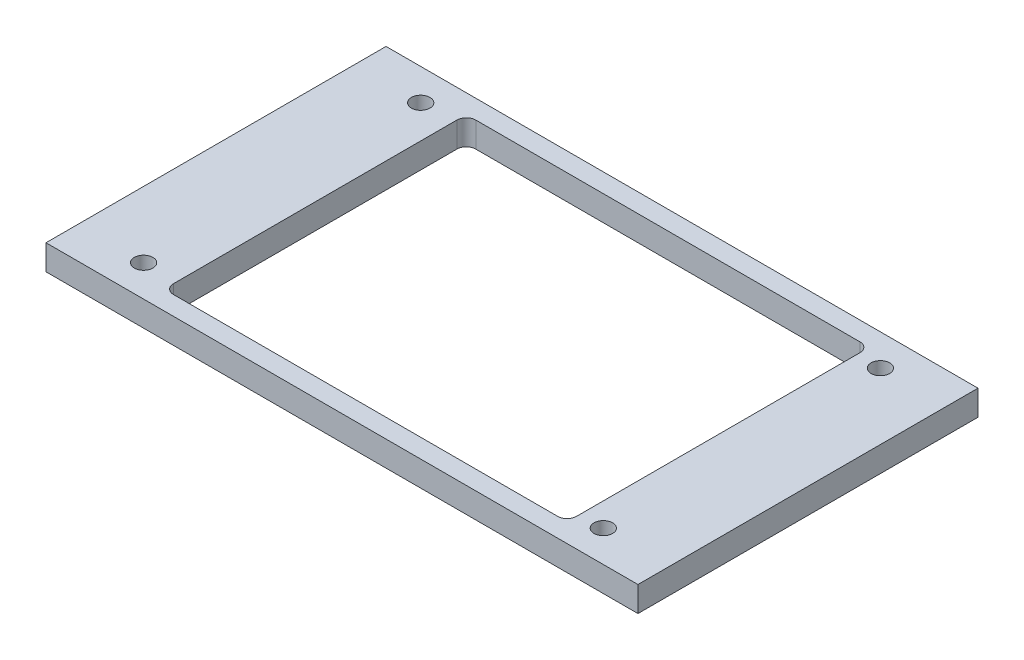
ISO-10303-21;
HEADER;
FILE_DESCRIPTION(('STEP AP214'),'2;1');
FILE_NAME('part.step','',(''),(''),'','','');
FILE_SCHEMA(('AUTOMOTIVE_DESIGN { 1 0 10303 214 1 1 1 1 }'));
ENDSEC;
DATA;
#1=APPLICATION_CONTEXT('core data for automotive mechanical design processes');
#2=APPLICATION_PROTOCOL_DEFINITION('international standard','automotive_design',2000,#1);
#3=PRODUCT_CONTEXT('',#1,'mechanical');
#4=PRODUCT('Part','Part','',(#3));
#5=PRODUCT_RELATED_PRODUCT_CATEGORY('part','',(#4));
#6=PRODUCT_DEFINITION_FORMATION('','',#4);
#7=PRODUCT_DEFINITION_CONTEXT('part definition',#1,'design');
#8=PRODUCT_DEFINITION('design','',#6,#7);
#9=PRODUCT_DEFINITION_SHAPE('','',#8);
#10=(LENGTH_UNIT() NAMED_UNIT(*) SI_UNIT(.MILLI.,.METRE.));
#11=(NAMED_UNIT(*) PLANE_ANGLE_UNIT() SI_UNIT($,.RADIAN.));
#12=(NAMED_UNIT(*) SI_UNIT($,.STERADIAN.) SOLID_ANGLE_UNIT());
#13=UNCERTAINTY_MEASURE_WITH_UNIT(LENGTH_MEASURE(1.E-05),#10,'distance_accuracy_value','');
#14=(GEOMETRIC_REPRESENTATION_CONTEXT(3) GLOBAL_UNCERTAINTY_ASSIGNED_CONTEXT((#13)) GLOBAL_UNIT_ASSIGNED_CONTEXT((#10,
#11,#12)) REPRESENTATION_CONTEXT('',''));
#15=CARTESIAN_POINT('',(0.,0.,0.));
#16=DIRECTION('',(0.,0.,1.));
#17=DIRECTION('',(1.,0.,0.));
#18=AXIS2_PLACEMENT_3D('',#15,#16,#17);
#19=CARTESIAN_POINT('',(94.,8.,54.));
#20=DIRECTION('',(-1.,0.,0.));
#21=DIRECTION('',(0.,0.,1.));
#22=AXIS2_PLACEMENT_3D('',#19,#20,#21);
#23=PLANE('',#22);
#24=DIRECTION('',(0.,0.,-1.));
#25=VECTOR('',#24,1.);
#26=CARTESIAN_POINT('',(94.,0.,54.));
#27=LINE('',#26,#25);
#28=CARTESIAN_POINT('',(94.,0.,54.));
#29=VERTEX_POINT('',#28);
#30=CARTESIAN_POINT('',(94.,0.,-54.));
#31=VERTEX_POINT('',#30);
#32=EDGE_CURVE('E144',#29,#31,#27,.T.);
#33=ORIENTED_EDGE('',*,*,#32,.T.);
#34=DIRECTION('',(0.,-1.,0.));
#35=VECTOR('',#34,1.);
#36=CARTESIAN_POINT('',(94.,8.,-54.));
#37=LINE('',#36,#35);
#38=CARTESIAN_POINT('',(94.,8.,-54.));
#39=VERTEX_POINT('',#38);
#40=EDGE_CURVE('E125',#39,#31,#37,.T.);
#41=ORIENTED_EDGE('',*,*,#40,.F.);
#42=DIRECTION('',(0.,0.,-1.));
#43=VECTOR('',#42,1.);
#44=CARTESIAN_POINT('',(94.,8.,54.));
#45=LINE('',#44,#43);
#46=CARTESIAN_POINT('',(94.,8.,54.));
#47=VERTEX_POINT('',#46);
#48=EDGE_CURVE('E132',#47,#39,#45,.T.);
#49=ORIENTED_EDGE('',*,*,#48,.F.);
#50=DIRECTION('',(0.,-1.,0.));
#51=VECTOR('',#50,1.);
#52=CARTESIAN_POINT('',(94.,8.,54.));
#53=LINE('',#52,#51);
#54=EDGE_CURVE('E216',#47,#29,#53,.T.);
#55=ORIENTED_EDGE('',*,*,#54,.T.);
#56=EDGE_LOOP('',(#33,#41,#49,#55));
#57=FACE_BOUND('',#56,.T.);
#58=ADVANCED_FACE('F32',(#57),#23,.F.);
#59=CARTESIAN_POINT('',(-94.,8.,-54.));
#60=DIRECTION('',(0.,0.,1.));
#61=DIRECTION('',(1.,0.,0.));
#62=AXIS2_PLACEMENT_3D('',#59,#60,#61);
#63=PLANE('',#62);
#64=DIRECTION('',(-1.,0.,0.));
#65=VECTOR('',#64,1.);
#66=CARTESIAN_POINT('',(-94.,0.,-54.));
#67=LINE('',#66,#65);
#68=CARTESIAN_POINT('',(-94.,0.,-54.));
#69=VERTEX_POINT('',#68);
#70=EDGE_CURVE('E218',#31,#69,#67,.T.);
#71=ORIENTED_EDGE('',*,*,#70,.T.);
#72=DIRECTION('',(0.,-1.,0.));
#73=VECTOR('',#72,1.);
#74=CARTESIAN_POINT('',(-94.,8.,-54.));
#75=LINE('',#74,#73);
#76=CARTESIAN_POINT('',(-94.,8.,-54.));
#77=VERTEX_POINT('',#76);
#78=EDGE_CURVE('E128',#77,#69,#75,.T.);
#79=ORIENTED_EDGE('',*,*,#78,.F.);
#80=DIRECTION('',(-1.,0.,0.));
#81=VECTOR('',#80,1.);
#82=CARTESIAN_POINT('',(-94.,8.,-54.));
#83=LINE('',#82,#81);
#84=EDGE_CURVE('E121',#39,#77,#83,.T.);
#85=ORIENTED_EDGE('',*,*,#84,.F.);
#86=ORIENTED_EDGE('',*,*,#40,.T.);
#87=EDGE_LOOP('',(#71,#79,#85,#86));
#88=FACE_BOUND('',#87,.T.);
#89=ADVANCED_FACE('F123',(#88),#63,.F.);
#90=CARTESIAN_POINT('',(-94.,8.,54.));
#91=DIRECTION('',(1.,0.,0.));
#92=DIRECTION('',(0.,0.,-1.));
#93=AXIS2_PLACEMENT_3D('',#90,#91,#92);
#94=PLANE('',#93);
#95=DIRECTION('',(0.,0.,1.));
#96=VECTOR('',#95,1.);
#97=CARTESIAN_POINT('',(-94.,0.,54.));
#98=LINE('',#97,#96);
#99=CARTESIAN_POINT('',(-94.,0.,54.));
#100=VERTEX_POINT('',#99);
#101=EDGE_CURVE('E220',#69,#100,#98,.T.);
#102=ORIENTED_EDGE('',*,*,#101,.T.);
#103=DIRECTION('',(0.,-1.,0.));
#104=VECTOR('',#103,1.);
#105=CARTESIAN_POINT('',(-94.,8.,54.));
#106=LINE('',#105,#104);
#107=CARTESIAN_POINT('',(-94.,8.,54.));
#108=VERTEX_POINT('',#107);
#109=EDGE_CURVE('E149',#108,#100,#106,.T.);
#110=ORIENTED_EDGE('',*,*,#109,.F.);
#111=DIRECTION('',(0.,0.,1.));
#112=VECTOR('',#111,1.);
#113=CARTESIAN_POINT('',(-94.,8.,54.));
#114=LINE('',#113,#112);
#115=EDGE_CURVE('E131',#77,#108,#114,.T.);
#116=ORIENTED_EDGE('',*,*,#115,.F.);
#117=ORIENTED_EDGE('',*,*,#78,.T.);
#118=EDGE_LOOP('',(#102,#110,#116,#117));
#119=FACE_BOUND('',#118,.T.);
#120=ADVANCED_FACE('F232',(#119),#94,.F.);
#121=CARTESIAN_POINT('',(-94.,8.,54.));
#122=DIRECTION('',(0.,0.,-1.));
#123=DIRECTION('',(-1.,0.,0.));
#124=AXIS2_PLACEMENT_3D('',#121,#122,#123);
#125=PLANE('',#124);
#126=DIRECTION('',(1.,0.,0.));
#127=VECTOR('',#126,1.);
#128=CARTESIAN_POINT('',(-94.,0.,54.));
#129=LINE('',#128,#127);
#130=EDGE_CURVE('E141',#100,#29,#129,.T.);
#131=ORIENTED_EDGE('',*,*,#130,.T.);
#132=ORIENTED_EDGE('',*,*,#54,.F.);
#133=DIRECTION('',(1.,0.,0.));
#134=VECTOR('',#133,1.);
#135=CARTESIAN_POINT('',(-94.,8.,54.));
#136=LINE('',#135,#134);
#137=EDGE_CURVE('E137',#108,#47,#136,.T.);
#138=ORIENTED_EDGE('',*,*,#137,.F.);
#139=ORIENTED_EDGE('',*,*,#109,.T.);
#140=EDGE_LOOP('',(#131,#132,#138,#139));
#141=FACE_BOUND('',#140,.T.);
#142=ADVANCED_FACE('F227',(#141),#125,.F.);
#143=CARTESIAN_POINT('',(0.,8.,0.));
#144=DIRECTION('',(0.,-1.,0.));
#145=DIRECTION('',(0.,0.,-1.));
#146=AXIS2_PLACEMENT_3D('',#143,#144,#145);
#147=PLANE('',#146);
#148=CARTESIAN_POINT('',(73.,8.,44.));
#149=DIRECTION('',(0.,1.,0.));
#150=DIRECTION('',(0.,0.,1.));
#151=AXIS2_PLACEMENT_3D('',#148,#149,#150);
#152=CIRCLE('',#151,2.95);
#153=CARTESIAN_POINT('',(73.,8.,46.95));
#154=VERTEX_POINT('',#153);
#155=EDGE_CURVE('E294',#154,#154,#152,.T.);
#156=ORIENTED_EDGE('',*,*,#155,.F.);
#157=EDGE_LOOP('',(#156));
#158=FACE_BOUND('',#157,.T.);
#159=CARTESIAN_POINT('',(-73.,8.,44.));
#160=DIRECTION('',(0.,1.,0.));
#161=DIRECTION('',(0.,0.,1.));
#162=AXIS2_PLACEMENT_3D('',#159,#160,#161);
#163=CIRCLE('',#162,2.95);
#164=CARTESIAN_POINT('',(-73.,8.,46.95));
#165=VERTEX_POINT('',#164);
#166=EDGE_CURVE('E288',#165,#165,#163,.T.);
#167=ORIENTED_EDGE('',*,*,#166,.F.);
#168=EDGE_LOOP('',(#167));
#169=FACE_BOUND('',#168,.T.);
#170=CARTESIAN_POINT('',(73.,8.,-44.));
#171=DIRECTION('',(0.,1.,0.));
#172=DIRECTION('',(0.,0.,1.));
#173=AXIS2_PLACEMENT_3D('',#170,#171,#172);
#174=CIRCLE('',#173,2.95);
#175=CARTESIAN_POINT('',(73.,8.,-41.05));
#176=VERTEX_POINT('',#175);
#177=EDGE_CURVE('E282',#176,#176,#174,.T.);
#178=ORIENTED_EDGE('',*,*,#177,.F.);
#179=EDGE_LOOP('',(#178));
#180=FACE_BOUND('',#179,.T.);
#181=CARTESIAN_POINT('',(-73.,8.,-44.));
#182=DIRECTION('',(0.,1.,0.));
#183=DIRECTION('',(0.,0.,1.));
#184=AXIS2_PLACEMENT_3D('',#181,#182,#183);
#185=CIRCLE('',#184,2.95);
#186=CARTESIAN_POINT('',(-73.,8.,-41.05));
#187=VERTEX_POINT('',#186);
#188=EDGE_CURVE('E276',#187,#187,#185,.T.);
#189=ORIENTED_EDGE('',*,*,#188,.F.);
#190=EDGE_LOOP('',(#189));
#191=FACE_BOUND('',#190,.T.);
#192=DIRECTION('',(-1.,0.,0.));
#193=VECTOR('',#192,1.);
#194=CARTESIAN_POINT('',(-62.5,8.,-48.));
#195=LINE('',#194,#193);
#196=CARTESIAN_POINT('',(62.5,8.,-48.));
#197=VERTEX_POINT('',#196);
#198=CARTESIAN_POINT('',(-59.5,8.,-48.));
#199=VERTEX_POINT('',#198);
#200=EDGE_CURVE('E184',#197,#199,#195,.T.);
#201=ORIENTED_EDGE('',*,*,#200,.F.);
#202=CARTESIAN_POINT('',(62.5,8.,-45.));
#203=DIRECTION('',(0.,-1.,0.));
#204=DIRECTION('',(0.,0.,-1.));
#205=AXIS2_PLACEMENT_3D('',#202,#203,#204);
#206=CIRCLE('',#205,3.);
#207=CARTESIAN_POINT('',(65.5,8.,-45.));
#208=VERTEX_POINT('',#207);
#209=EDGE_CURVE('E173',#197,#208,#206,.T.);
#210=ORIENTED_EDGE('',*,*,#209,.T.);
#211=DIRECTION('',(0.,0.,-1.));
#212=VECTOR('',#211,1.);
#213=CARTESIAN_POINT('',(65.5,8.,48.));
#214=LINE('',#213,#212);
#215=CARTESIAN_POINT('',(65.5,8.,45.));
#216=VERTEX_POINT('',#215);
#217=EDGE_CURVE('E193',#216,#208,#214,.T.);
#218=ORIENTED_EDGE('',*,*,#217,.F.);
#219=CARTESIAN_POINT('',(62.5,8.,45.));
#220=DIRECTION('',(0.,-1.,0.));
#221=DIRECTION('',(0.,0.,-1.));
#222=AXIS2_PLACEMENT_3D('',#219,#220,#221);
#223=CIRCLE('',#222,3.);
#224=CARTESIAN_POINT('',(62.5,8.,48.));
#225=VERTEX_POINT('',#224);
#226=EDGE_CURVE('E169',#216,#225,#223,.T.);
#227=ORIENTED_EDGE('',*,*,#226,.T.);
#228=DIRECTION('',(1.,0.,0.));
#229=VECTOR('',#228,1.);
#230=CARTESIAN_POINT('',(-62.5,8.,48.));
#231=LINE('',#230,#229);
#232=CARTESIAN_POINT('',(-59.5,8.,48.));
#233=VERTEX_POINT('',#232);
#234=EDGE_CURVE('E211',#233,#225,#231,.T.);
#235=ORIENTED_EDGE('',*,*,#234,.F.);
#236=CARTESIAN_POINT('',(-59.5,8.,45.));
#237=DIRECTION('',(0.,-1.,0.));
#238=DIRECTION('',(0.,0.,-1.));
#239=AXIS2_PLACEMENT_3D('',#236,#237,#238);
#240=CIRCLE('',#239,3.);
#241=CARTESIAN_POINT('',(-62.5,8.,45.));
#242=VERTEX_POINT('',#241);
#243=EDGE_CURVE('E177',#233,#242,#240,.T.);
#244=ORIENTED_EDGE('',*,*,#243,.T.);
#245=DIRECTION('',(0.,0.,1.));
#246=VECTOR('',#245,1.);
#247=CARTESIAN_POINT('',(-62.5,8.,48.));
#248=LINE('',#247,#246);
#249=CARTESIAN_POINT('',(-62.5,8.,-45.));
#250=VERTEX_POINT('',#249);
#251=EDGE_CURVE('E185',#250,#242,#248,.T.);
#252=ORIENTED_EDGE('',*,*,#251,.F.);
#253=CARTESIAN_POINT('',(-59.5,8.,-45.));
#254=DIRECTION('',(0.,-1.,0.));
#255=DIRECTION('',(0.,0.,-1.));
#256=AXIS2_PLACEMENT_3D('',#253,#254,#255);
#257=CIRCLE('',#256,3.);
#258=EDGE_CURVE('E40',#250,#199,#257,.T.);
#259=ORIENTED_EDGE('',*,*,#258,.T.);
#260=EDGE_LOOP('',(#201,#210,#218,#227,#235,#244,#252,#259));
#261=FACE_BOUND('',#260,.T.);
#262=ORIENTED_EDGE('',*,*,#48,.T.);
#263=ORIENTED_EDGE('',*,*,#84,.T.);
#264=ORIENTED_EDGE('',*,*,#115,.T.);
#265=ORIENTED_EDGE('',*,*,#137,.T.);
#266=EDGE_LOOP('',(#262,#263,#264,#265));
#267=FACE_BOUND('',#266,.T.);
#268=ADVANCED_FACE('F135',(#158,#169,#180,#191,#261,#267),#147,.F.);
#269=CARTESIAN_POINT('',(0.,0.,0.));
#270=DIRECTION('',(0.,-1.,0.));
#271=DIRECTION('',(0.,0.,-1.));
#272=AXIS2_PLACEMENT_3D('',#269,#270,#271);
#273=PLANE('',#272);
#274=CARTESIAN_POINT('',(73.,0.,44.));
#275=DIRECTION('',(0.,1.,0.));
#276=DIRECTION('',(0.,0.,1.));
#277=AXIS2_PLACEMENT_3D('',#274,#275,#276);
#278=CIRCLE('',#277,2.95);
#279=CARTESIAN_POINT('',(73.,0.,46.95));
#280=VERTEX_POINT('',#279);
#281=EDGE_CURVE('E291',#280,#280,#278,.T.);
#282=ORIENTED_EDGE('',*,*,#281,.T.);
#283=EDGE_LOOP('',(#282));
#284=FACE_BOUND('',#283,.T.);
#285=CARTESIAN_POINT('',(-73.,0.,44.));
#286=DIRECTION('',(0.,1.,0.));
#287=DIRECTION('',(0.,0.,1.));
#288=AXIS2_PLACEMENT_3D('',#285,#286,#287);
#289=CIRCLE('',#288,2.95);
#290=CARTESIAN_POINT('',(-73.,0.,46.95));
#291=VERTEX_POINT('',#290);
#292=EDGE_CURVE('E285',#291,#291,#289,.T.);
#293=ORIENTED_EDGE('',*,*,#292,.T.);
#294=EDGE_LOOP('',(#293));
#295=FACE_BOUND('',#294,.T.);
#296=CARTESIAN_POINT('',(73.,0.,-44.));
#297=DIRECTION('',(0.,1.,0.));
#298=DIRECTION('',(0.,0.,1.));
#299=AXIS2_PLACEMENT_3D('',#296,#297,#298);
#300=CIRCLE('',#299,2.95);
#301=CARTESIAN_POINT('',(73.,0.,-41.05));
#302=VERTEX_POINT('',#301);
#303=EDGE_CURVE('E279',#302,#302,#300,.T.);
#304=ORIENTED_EDGE('',*,*,#303,.T.);
#305=EDGE_LOOP('',(#304));
#306=FACE_BOUND('',#305,.T.);
#307=CARTESIAN_POINT('',(-73.,0.,-44.));
#308=DIRECTION('',(0.,1.,0.));
#309=DIRECTION('',(0.,0.,1.));
#310=AXIS2_PLACEMENT_3D('',#307,#308,#309);
#311=CIRCLE('',#310,2.95);
#312=CARTESIAN_POINT('',(-73.,0.,-41.05));
#313=VERTEX_POINT('',#312);
#314=EDGE_CURVE('E208',#313,#313,#311,.T.);
#315=ORIENTED_EDGE('',*,*,#314,.T.);
#316=EDGE_LOOP('',(#315));
#317=FACE_BOUND('',#316,.T.);
#318=DIRECTION('',(1.,0.,0.));
#319=VECTOR('',#318,1.);
#320=CARTESIAN_POINT('',(-62.5,0.,48.));
#321=LINE('',#320,#319);
#322=CARTESIAN_POINT('',(-59.5,0.,48.));
#323=VERTEX_POINT('',#322);
#324=CARTESIAN_POINT('',(62.5,0.,48.));
#325=VERTEX_POINT('',#324);
#326=EDGE_CURVE('E198',#323,#325,#321,.T.);
#327=ORIENTED_EDGE('',*,*,#326,.T.);
#328=CARTESIAN_POINT('',(62.5,0.,45.));
#329=DIRECTION('',(0.,-1.,0.));
#330=DIRECTION('',(0.,0.,-1.));
#331=AXIS2_PLACEMENT_3D('',#328,#329,#330);
#332=CIRCLE('',#331,3.);
#333=CARTESIAN_POINT('',(65.5,0.,45.));
#334=VERTEX_POINT('',#333);
#335=EDGE_CURVE('E171',#325,#334,#332,.F.);
#336=ORIENTED_EDGE('',*,*,#335,.T.);
#337=DIRECTION('',(0.,0.,-1.));
#338=VECTOR('',#337,1.);
#339=CARTESIAN_POINT('',(65.5,0.,48.));
#340=LINE('',#339,#338);
#341=CARTESIAN_POINT('',(65.5,0.,-45.));
#342=VERTEX_POINT('',#341);
#343=EDGE_CURVE('E203',#334,#342,#340,.T.);
#344=ORIENTED_EDGE('',*,*,#343,.T.);
#345=CARTESIAN_POINT('',(62.5,0.,-45.));
#346=DIRECTION('',(0.,-1.,0.));
#347=DIRECTION('',(0.,0.,-1.));
#348=AXIS2_PLACEMENT_3D('',#345,#346,#347);
#349=CIRCLE('',#348,3.);
#350=CARTESIAN_POINT('',(62.5,0.,-48.));
#351=VERTEX_POINT('',#350);
#352=EDGE_CURVE('E175',#342,#351,#349,.F.);
#353=ORIENTED_EDGE('',*,*,#352,.T.);
#354=DIRECTION('',(-1.,0.,0.));
#355=VECTOR('',#354,1.);
#356=CARTESIAN_POINT('',(-62.5,0.,-48.));
#357=LINE('',#356,#355);
#358=CARTESIAN_POINT('',(-59.5,0.,-48.));
#359=VERTEX_POINT('',#358);
#360=EDGE_CURVE('E199',#351,#359,#357,.T.);
#361=ORIENTED_EDGE('',*,*,#360,.T.);
#362=CARTESIAN_POINT('',(-59.5,0.,-45.));
#363=DIRECTION('',(0.,-1.,0.));
#364=DIRECTION('',(0.,0.,-1.));
#365=AXIS2_PLACEMENT_3D('',#362,#363,#364);
#366=CIRCLE('',#365,3.);
#367=CARTESIAN_POINT('',(-62.5,0.,-45.));
#368=VERTEX_POINT('',#367);
#369=EDGE_CURVE('E11',#359,#368,#366,.F.);
#370=ORIENTED_EDGE('',*,*,#369,.T.);
#371=DIRECTION('',(0.,0.,1.));
#372=VECTOR('',#371,1.);
#373=CARTESIAN_POINT('',(-62.5,0.,48.));
#374=LINE('',#373,#372);
#375=CARTESIAN_POINT('',(-62.5,0.,45.));
#376=VERTEX_POINT('',#375);
#377=EDGE_CURVE('E196',#368,#376,#374,.T.);
#378=ORIENTED_EDGE('',*,*,#377,.T.);
#379=CARTESIAN_POINT('',(-59.5,0.,45.));
#380=DIRECTION('',(0.,-1.,0.));
#381=DIRECTION('',(0.,0.,-1.));
#382=AXIS2_PLACEMENT_3D('',#379,#380,#381);
#383=CIRCLE('',#382,3.);
#384=EDGE_CURVE('E179',#376,#323,#383,.F.);
#385=ORIENTED_EDGE('',*,*,#384,.T.);
#386=EDGE_LOOP('',(#327,#336,#344,#353,#361,#370,#378,#385));
#387=FACE_BOUND('',#386,.T.);
#388=ORIENTED_EDGE('',*,*,#32,.F.);
#389=ORIENTED_EDGE('',*,*,#130,.F.);
#390=ORIENTED_EDGE('',*,*,#101,.F.);
#391=ORIENTED_EDGE('',*,*,#70,.F.);
#392=EDGE_LOOP('',(#388,#389,#390,#391));
#393=FACE_BOUND('',#392,.T.);
#394=ADVANCED_FACE('F231',(#284,#295,#306,#317,#387,#393),#273,.T.);
#395=CARTESIAN_POINT('',(65.5,0.,48.));
#396=DIRECTION('',(1.,0.,0.));
#397=DIRECTION('',(0.,0.,-1.));
#398=AXIS2_PLACEMENT_3D('',#395,#396,#397);
#399=PLANE('',#398);
#400=ORIENTED_EDGE('',*,*,#343,.F.);
#401=DIRECTION('',(0.,1.,0.));
#402=VECTOR('',#401,1.);
#403=CARTESIAN_POINT('',(65.5,8.,45.));
#404=LINE('',#403,#402);
#405=EDGE_CURVE('E147',#334,#216,#404,.T.);
#406=ORIENTED_EDGE('',*,*,#405,.T.);
#407=ORIENTED_EDGE('',*,*,#217,.T.);
#408=DIRECTION('',(0.,1.,0.));
#409=VECTOR('',#408,1.);
#410=CARTESIAN_POINT('',(65.5,0.,-45.));
#411=LINE('',#410,#409);
#412=EDGE_CURVE('E145',#208,#342,#411,.F.);
#413=ORIENTED_EDGE('',*,*,#412,.T.);
#414=EDGE_LOOP('',(#400,#406,#407,#413));
#415=FACE_BOUND('',#414,.T.);
#416=ADVANCED_FACE('F272',(#415),#399,.F.);
#417=CARTESIAN_POINT('',(-62.5,0.,48.));
#418=DIRECTION('',(0.,0.,1.));
#419=DIRECTION('',(1.,0.,0.));
#420=AXIS2_PLACEMENT_3D('',#417,#418,#419);
#421=PLANE('',#420);
#422=ORIENTED_EDGE('',*,*,#234,.T.);
#423=DIRECTION('',(0.,1.,0.));
#424=VECTOR('',#423,1.);
#425=CARTESIAN_POINT('',(62.5,0.,48.));
#426=LINE('',#425,#424);
#427=EDGE_CURVE('E158',#225,#325,#426,.F.);
#428=ORIENTED_EDGE('',*,*,#427,.T.);
#429=ORIENTED_EDGE('',*,*,#326,.F.);
#430=DIRECTION('',(0.,1.,0.));
#431=VECTOR('',#430,1.);
#432=CARTESIAN_POINT('',(-59.5,8.,48.));
#433=LINE('',#432,#431);
#434=EDGE_CURVE('E155',#323,#233,#433,.T.);
#435=ORIENTED_EDGE('',*,*,#434,.T.);
#436=EDGE_LOOP('',(#422,#428,#429,#435));
#437=FACE_BOUND('',#436,.T.);
#438=ADVANCED_FACE('F264',(#437),#421,.F.);
#439=CARTESIAN_POINT('',(-62.5,0.,48.));
#440=DIRECTION('',(-1.,0.,0.));
#441=DIRECTION('',(0.,0.,1.));
#442=AXIS2_PLACEMENT_3D('',#439,#440,#441);
#443=PLANE('',#442);
#444=ORIENTED_EDGE('',*,*,#251,.T.);
#445=DIRECTION('',(0.,1.,0.));
#446=VECTOR('',#445,1.);
#447=CARTESIAN_POINT('',(-62.5,0.,45.));
#448=LINE('',#447,#446);
#449=EDGE_CURVE('E47',#242,#376,#448,.F.);
#450=ORIENTED_EDGE('',*,*,#449,.T.);
#451=ORIENTED_EDGE('',*,*,#377,.F.);
#452=DIRECTION('',(0.,1.,0.));
#453=VECTOR('',#452,1.);
#454=CARTESIAN_POINT('',(-62.5,8.,-45.));
#455=LINE('',#454,#453);
#456=EDGE_CURVE('E165',#368,#250,#455,.T.);
#457=ORIENTED_EDGE('',*,*,#456,.T.);
#458=EDGE_LOOP('',(#444,#450,#451,#457));
#459=FACE_BOUND('',#458,.T.);
#460=ADVANCED_FACE('F195',(#459),#443,.F.);
#461=CARTESIAN_POINT('',(-62.5,0.,-48.));
#462=DIRECTION('',(0.,0.,-1.));
#463=DIRECTION('',(-1.,0.,0.));
#464=AXIS2_PLACEMENT_3D('',#461,#462,#463);
#465=PLANE('',#464);
#466=ORIENTED_EDGE('',*,*,#360,.F.);
#467=DIRECTION('',(0.,1.,0.));
#468=VECTOR('',#467,1.);
#469=CARTESIAN_POINT('',(62.5,8.,-48.));
#470=LINE('',#469,#468);
#471=EDGE_CURVE('E162',#351,#197,#470,.T.);
#472=ORIENTED_EDGE('',*,*,#471,.T.);
#473=ORIENTED_EDGE('',*,*,#200,.T.);
#474=DIRECTION('',(0.,1.,0.));
#475=VECTOR('',#474,1.);
#476=CARTESIAN_POINT('',(-59.5,0.,-48.));
#477=LINE('',#476,#475);
#478=EDGE_CURVE('E160',#199,#359,#477,.F.);
#479=ORIENTED_EDGE('',*,*,#478,.T.);
#480=EDGE_LOOP('',(#466,#472,#473,#479));
#481=FACE_BOUND('',#480,.T.);
#482=ADVANCED_FACE('F191',(#481),#465,.F.);
#483=CARTESIAN_POINT('',(-73.,0.,-44.));
#484=DIRECTION('',(0.,1.,0.));
#485=DIRECTION('',(0.,0.,1.));
#486=AXIS2_PLACEMENT_3D('',#483,#484,#485);
#487=CYLINDRICAL_SURFACE('',#486,2.95);
#488=ORIENTED_EDGE('',*,*,#314,.F.);
#489=EDGE_LOOP('',(#488));
#490=FACE_BOUND('',#489,.T.);
#491=ORIENTED_EDGE('',*,*,#188,.T.);
#492=EDGE_LOOP('',(#491));
#493=FACE_BOUND('',#492,.T.);
#494=ADVANCED_FACE('F317',(#490,#493),#487,.F.);
#495=CARTESIAN_POINT('',(73.,0.,-44.));
#496=DIRECTION('',(0.,1.,0.));
#497=DIRECTION('',(0.,0.,1.));
#498=AXIS2_PLACEMENT_3D('',#495,#496,#497);
#499=CYLINDRICAL_SURFACE('',#498,2.95);
#500=ORIENTED_EDGE('',*,*,#303,.F.);
#501=EDGE_LOOP('',(#500));
#502=FACE_BOUND('',#501,.T.);
#503=ORIENTED_EDGE('',*,*,#177,.T.);
#504=EDGE_LOOP('',(#503));
#505=FACE_BOUND('',#504,.T.);
#506=ADVANCED_FACE('F319',(#502,#505),#499,.F.);
#507=CARTESIAN_POINT('',(-73.,0.,44.));
#508=DIRECTION('',(0.,1.,0.));
#509=DIRECTION('',(0.,0.,1.));
#510=AXIS2_PLACEMENT_3D('',#507,#508,#509);
#511=CYLINDRICAL_SURFACE('',#510,2.95);
#512=ORIENTED_EDGE('',*,*,#292,.F.);
#513=EDGE_LOOP('',(#512));
#514=FACE_BOUND('',#513,.T.);
#515=ORIENTED_EDGE('',*,*,#166,.T.);
#516=EDGE_LOOP('',(#515));
#517=FACE_BOUND('',#516,.T.);
#518=ADVANCED_FACE('F304',(#514,#517),#511,.F.);
#519=CARTESIAN_POINT('',(73.,0.,44.));
#520=DIRECTION('',(0.,1.,0.));
#521=DIRECTION('',(0.,0.,1.));
#522=AXIS2_PLACEMENT_3D('',#519,#520,#521);
#523=CYLINDRICAL_SURFACE('',#522,2.95);
#524=ORIENTED_EDGE('',*,*,#281,.F.);
#525=EDGE_LOOP('',(#524));
#526=FACE_BOUND('',#525,.T.);
#527=ORIENTED_EDGE('',*,*,#155,.T.);
#528=EDGE_LOOP('',(#527));
#529=FACE_BOUND('',#528,.T.);
#530=ADVANCED_FACE('F250',(#526,#529),#523,.F.);
#531=CARTESIAN_POINT('',(62.5,0.,45.));
#532=DIRECTION('',(0.,-1.,0.));
#533=DIRECTION('',(0.,0.,-1.));
#534=AXIS2_PLACEMENT_3D('',#531,#532,#533);
#535=CYLINDRICAL_SURFACE('',#534,3.);
#536=ORIENTED_EDGE('',*,*,#335,.F.);
#537=ORIENTED_EDGE('',*,*,#427,.F.);
#538=ORIENTED_EDGE('',*,*,#226,.F.);
#539=ORIENTED_EDGE('',*,*,#405,.F.);
#540=EDGE_LOOP('',(#536,#537,#538,#539));
#541=FACE_BOUND('',#540,.T.);
#542=ADVANCED_FACE('F246',(#541),#535,.F.);
#543=CARTESIAN_POINT('',(62.5,0.,-45.));
#544=DIRECTION('',(0.,-1.,0.));
#545=DIRECTION('',(0.,0.,-1.));
#546=AXIS2_PLACEMENT_3D('',#543,#544,#545);
#547=CYLINDRICAL_SURFACE('',#546,3.);
#548=ORIENTED_EDGE('',*,*,#352,.F.);
#549=ORIENTED_EDGE('',*,*,#412,.F.);
#550=ORIENTED_EDGE('',*,*,#209,.F.);
#551=ORIENTED_EDGE('',*,*,#471,.F.);
#552=EDGE_LOOP('',(#548,#549,#550,#551));
#553=FACE_BOUND('',#552,.T.);
#554=ADVANCED_FACE('F249',(#553),#547,.F.);
#555=CARTESIAN_POINT('',(-59.5,0.,45.));
#556=DIRECTION('',(0.,-1.,0.));
#557=DIRECTION('',(0.,0.,-1.));
#558=AXIS2_PLACEMENT_3D('',#555,#556,#557);
#559=CYLINDRICAL_SURFACE('',#558,3.);
#560=ORIENTED_EDGE('',*,*,#384,.F.);
#561=ORIENTED_EDGE('',*,*,#449,.F.);
#562=ORIENTED_EDGE('',*,*,#243,.F.);
#563=ORIENTED_EDGE('',*,*,#434,.F.);
#564=EDGE_LOOP('',(#560,#561,#562,#563));
#565=FACE_BOUND('',#564,.T.);
#566=ADVANCED_FACE('F253',(#565),#559,.F.);
#567=CARTESIAN_POINT('',(-59.5,0.,-45.));
#568=DIRECTION('',(0.,-1.,0.));
#569=DIRECTION('',(0.,0.,-1.));
#570=AXIS2_PLACEMENT_3D('',#567,#568,#569);
#571=CYLINDRICAL_SURFACE('',#570,3.);
#572=ORIENTED_EDGE('',*,*,#369,.F.);
#573=ORIENTED_EDGE('',*,*,#478,.F.);
#574=ORIENTED_EDGE('',*,*,#258,.F.);
#575=ORIENTED_EDGE('',*,*,#456,.F.);
#576=EDGE_LOOP('',(#572,#573,#574,#575));
#577=FACE_BOUND('',#576,.T.);
#578=ADVANCED_FACE('F34',(#577),#571,.F.);
#579=CLOSED_SHELL('',(#58,#89,#120,#142,#268,#394,#416,#438,#460,#482,#494,#506,#518,#530,#542,
#554,#566,#578));
#580=MANIFOLD_SOLID_BREP('B2',#579);
#581=ADVANCED_BREP_SHAPE_REPRESENTATION('',(#18,#580),#14);
#582=SHAPE_DEFINITION_REPRESENTATION(#9,#581);
ENDSEC;
END-ISO-10303-21;
